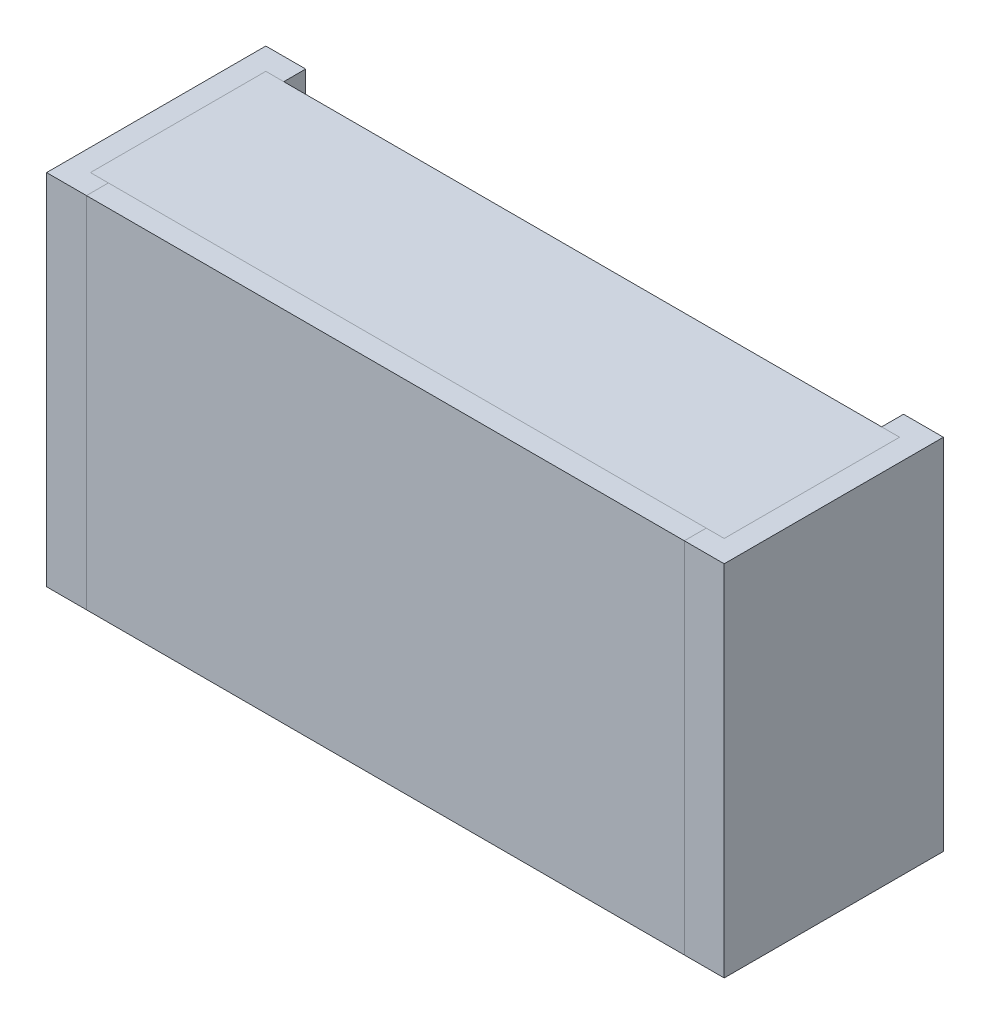
ISO-10303-21;
HEADER;
FILE_DESCRIPTION(('STEP AP214'),'2;1');
FILE_NAME('part.step','',(''),(''),'','','');
FILE_SCHEMA(('AUTOMOTIVE_DESIGN { 1 0 10303 214 1 1 1 1 }'));
ENDSEC;
DATA;
#1=APPLICATION_CONTEXT('core data for automotive mechanical design processes');
#2=APPLICATION_PROTOCOL_DEFINITION('international standard','automotive_design',2000,#1);
#3=PRODUCT_CONTEXT('',#1,'mechanical');
#4=PRODUCT('Part','Part','',(#3));
#5=PRODUCT_RELATED_PRODUCT_CATEGORY('part','',(#4));
#6=PRODUCT_DEFINITION_FORMATION('','',#4);
#7=PRODUCT_DEFINITION_CONTEXT('part definition',#1,'design');
#8=PRODUCT_DEFINITION('design','',#6,#7);
#9=PRODUCT_DEFINITION_SHAPE('','',#8);
#10=(LENGTH_UNIT() NAMED_UNIT(*) SI_UNIT(.MILLI.,.METRE.));
#11=(NAMED_UNIT(*) PLANE_ANGLE_UNIT() SI_UNIT($,.RADIAN.));
#12=(NAMED_UNIT(*) SI_UNIT($,.STERADIAN.) SOLID_ANGLE_UNIT());
#13=UNCERTAINTY_MEASURE_WITH_UNIT(LENGTH_MEASURE(1.E-05),#10,'distance_accuracy_value','');
#14=(GEOMETRIC_REPRESENTATION_CONTEXT(3) GLOBAL_UNCERTAINTY_ASSIGNED_CONTEXT((#13)) GLOBAL_UNIT_ASSIGNED_CONTEXT((#10,
#11,#12)) REPRESENTATION_CONTEXT('',''));
#15=CARTESIAN_POINT('',(0.,0.,0.));
#16=DIRECTION('',(0.,0.,1.));
#17=DIRECTION('',(1.,0.,0.));
#18=AXIS2_PLACEMENT_3D('',#15,#16,#17);
#19=CARTESIAN_POINT('',(-0.79491872,-0.44991872,0.055));
#20=DIRECTION('',(1.,0.,0.));
#21=DIRECTION('',(0.,0.,1.));
#22=AXIS2_PLACEMENT_3D('',#19,#20,#21);
#23=PLANE('',#22);
#24=DIRECTION('',(0.,1.,0.));
#25=VECTOR('',#24,1.);
#26=CARTESIAN_POINT('',(-0.79491872,-0.44991872,0.495));
#27=LINE('',#26,#25);
#28=CARTESIAN_POINT('',(-0.79491872,-0.44991872,0.495));
#29=VERTEX_POINT('',#28);
#30=CARTESIAN_POINT('',(-0.79491872,0.45008128,0.495));
#31=VERTEX_POINT('',#30);
#32=EDGE_CURVE('P0_E11',#29,#31,#27,.T.);
#33=ORIENTED_EDGE('',*,*,#32,.T.);
#34=DIRECTION('',(0.,0.,1.));
#35=VECTOR('',#34,1.);
#36=CARTESIAN_POINT('',(-0.79491872,0.45008128,0.055));
#37=LINE('',#36,#35);
#38=CARTESIAN_POINT('',(-0.79491872,0.45008128,0.055));
#39=VERTEX_POINT('',#38);
#40=EDGE_CURVE('P0_E24',#39,#31,#37,.T.);
#41=ORIENTED_EDGE('',*,*,#40,.F.);
#42=DIRECTION('',(0.,1.,0.));
#43=VECTOR('',#42,1.);
#44=CARTESIAN_POINT('',(-0.79491872,-0.44991872,0.055));
#45=LINE('',#44,#43);
#46=CARTESIAN_POINT('',(-0.79491872,-0.44991872,0.055));
#47=VERTEX_POINT('',#46);
#48=EDGE_CURVE('P0_E86',#47,#39,#45,.T.);
#49=ORIENTED_EDGE('',*,*,#48,.F.);
#50=DIRECTION('',(0.,0.,1.));
#51=VECTOR('',#50,1.);
#52=CARTESIAN_POINT('',(-0.79491872,-0.44991872,0.055));
#53=LINE('',#52,#51);
#54=EDGE_CURVE('P0_E36',#47,#29,#53,.T.);
#55=ORIENTED_EDGE('',*,*,#54,.T.);
#56=EDGE_LOOP('',(#33,#41,#49,#55));
#57=FACE_BOUND('',#56,.T.);
#58=ADVANCED_FACE('P0_F17',(#57),#23,.F.);
#59=CARTESIAN_POINT('',(0.79508128,-0.44991872,0.055));
#60=DIRECTION('',(1.,0.,0.));
#61=DIRECTION('',(0.,0.,1.));
#62=AXIS2_PLACEMENT_3D('',#59,#60,#61);
#63=PLANE('',#62);
#64=DIRECTION('',(0.,0.,1.));
#65=VECTOR('',#64,1.);
#66=CARTESIAN_POINT('',(0.79508128,-0.44991872,0.055));
#67=LINE('',#66,#65);
#68=CARTESIAN_POINT('',(0.79508128,-0.44991872,0.055));
#69=VERTEX_POINT('',#68);
#70=CARTESIAN_POINT('',(0.79508128,-0.44991872,0.495));
#71=VERTEX_POINT('',#70);
#72=EDGE_CURVE('P0_E83',#69,#71,#67,.T.);
#73=ORIENTED_EDGE('',*,*,#72,.F.);
#74=DIRECTION('',(0.,1.,0.));
#75=VECTOR('',#74,1.);
#76=CARTESIAN_POINT('',(0.79508128,-0.44991872,0.055));
#77=LINE('',#76,#75);
#78=CARTESIAN_POINT('',(0.79508128,0.45008128,0.055));
#79=VERTEX_POINT('',#78);
#80=EDGE_CURVE('P0_E63',#69,#79,#77,.T.);
#81=ORIENTED_EDGE('',*,*,#80,.T.);
#82=DIRECTION('',(0.,0.,1.));
#83=VECTOR('',#82,1.);
#84=CARTESIAN_POINT('',(0.79508128,0.45008128,0.055));
#85=LINE('',#84,#83);
#86=CARTESIAN_POINT('',(0.79508128,0.45008128,0.495));
#87=VERTEX_POINT('',#86);
#88=EDGE_CURVE('P0_E57',#79,#87,#85,.T.);
#89=ORIENTED_EDGE('',*,*,#88,.T.);
#90=DIRECTION('',(0.,1.,0.));
#91=VECTOR('',#90,1.);
#92=CARTESIAN_POINT('',(0.79508128,-0.44991872,0.495));
#93=LINE('',#92,#91);
#94=EDGE_CURVE('P0_E60',#71,#87,#93,.T.);
#95=ORIENTED_EDGE('',*,*,#94,.F.);
#96=EDGE_LOOP('',(#73,#81,#89,#95));
#97=FACE_BOUND('',#96,.T.);
#98=ADVANCED_FACE('P0_F59',(#97),#63,.T.);
#99=CARTESIAN_POINT('',(-0.79491872,-0.44991872,0.055));
#100=DIRECTION('',(0.,1.,0.));
#101=DIRECTION('',(0.,0.,1.));
#102=AXIS2_PLACEMENT_3D('',#99,#100,#101);
#103=PLANE('',#102);
#104=ORIENTED_EDGE('',*,*,#72,.T.);
#105=DIRECTION('',(1.,0.,0.));
#106=VECTOR('',#105,1.);
#107=CARTESIAN_POINT('',(-0.79491872,-0.44991872,0.495));
#108=LINE('',#107,#106);
#109=EDGE_CURVE('P0_E71',#29,#71,#108,.T.);
#110=ORIENTED_EDGE('',*,*,#109,.F.);
#111=ORIENTED_EDGE('',*,*,#54,.F.);
#112=DIRECTION('',(1.,0.,0.));
#113=VECTOR('',#112,1.);
#114=CARTESIAN_POINT('',(-0.79491872,-0.44991872,0.055));
#115=LINE('',#114,#113);
#116=EDGE_CURVE('P0_E76',#47,#69,#115,.T.);
#117=ORIENTED_EDGE('',*,*,#116,.T.);
#118=EDGE_LOOP('',(#104,#110,#111,#117));
#119=FACE_BOUND('',#118,.T.);
#120=ADVANCED_FACE('P0_F91',(#119),#103,.F.);
#121=CARTESIAN_POINT('',(-0.79491872,0.45008128,0.055));
#122=DIRECTION('',(0.,1.,0.));
#123=DIRECTION('',(0.,0.,1.));
#124=AXIS2_PLACEMENT_3D('',#121,#122,#123);
#125=PLANE('',#124);
#126=DIRECTION('',(1.,0.,0.));
#127=VECTOR('',#126,1.);
#128=CARTESIAN_POINT('',(-0.79491872,0.45008128,0.055));
#129=LINE('',#128,#127);
#130=EDGE_CURVE('P0_E74',#39,#79,#129,.T.);
#131=ORIENTED_EDGE('',*,*,#130,.F.);
#132=ORIENTED_EDGE('',*,*,#40,.T.);
#133=DIRECTION('',(1.,0.,0.));
#134=VECTOR('',#133,1.);
#135=CARTESIAN_POINT('',(-0.79491872,0.45008128,0.495));
#136=LINE('',#135,#134);
#137=EDGE_CURVE('P0_E69',#31,#87,#136,.T.);
#138=ORIENTED_EDGE('',*,*,#137,.T.);
#139=ORIENTED_EDGE('',*,*,#88,.F.);
#140=EDGE_LOOP('',(#131,#132,#138,#139));
#141=FACE_BOUND('',#140,.T.);
#142=ADVANCED_FACE('P0_F73',(#141),#125,.T.);
#143=CARTESIAN_POINT('',(-0.79491872,-0.44991872,0.055));
#144=DIRECTION('',(0.,0.,1.));
#145=DIRECTION('',(1.,0.,0.));
#146=AXIS2_PLACEMENT_3D('',#143,#144,#145);
#147=PLANE('',#146);
#148=ORIENTED_EDGE('',*,*,#130,.T.);
#149=ORIENTED_EDGE('',*,*,#80,.F.);
#150=ORIENTED_EDGE('',*,*,#116,.F.);
#151=ORIENTED_EDGE('',*,*,#48,.T.);
#152=EDGE_LOOP('',(#148,#149,#150,#151));
#153=FACE_BOUND('',#152,.T.);
#154=ADVANCED_FACE('P0_F89',(#153),#147,.F.);
#155=CARTESIAN_POINT('',(-0.79491872,-0.44991872,0.495));
#156=DIRECTION('',(0.,0.,1.));
#157=DIRECTION('',(1.,0.,0.));
#158=AXIS2_PLACEMENT_3D('',#155,#156,#157);
#159=PLANE('',#158);
#160=ORIENTED_EDGE('',*,*,#32,.F.);
#161=ORIENTED_EDGE('',*,*,#109,.T.);
#162=ORIENTED_EDGE('',*,*,#94,.T.);
#163=ORIENTED_EDGE('',*,*,#137,.F.);
#164=EDGE_LOOP('',(#160,#161,#162,#163));
#165=FACE_BOUND('',#164,.T.);
#166=ADVANCED_FACE('P0_F68',(#165),#159,.T.);
#167=CLOSED_SHELL('',(#58,#98,#120,#142,#154,#166));
#168=MANIFOLD_SOLID_BREP('P0_B1',#167);
#169=CARTESIAN_POINT('',(-0.84991872,-0.44991872,0.));
#170=DIRECTION('',(1.,0.,0.));
#171=DIRECTION('',(0.,0.,1.));
#172=AXIS2_PLACEMENT_3D('',#169,#170,#171);
#173=PLANE('',#172);
#174=DIRECTION('',(0.,1.,0.));
#175=VECTOR('',#174,1.);
#176=CARTESIAN_POINT('',(-0.84991872,-0.44991872,0.55));
#177=LINE('',#176,#175);
#178=CARTESIAN_POINT('',(-0.84991872,-0.44991872,0.55));
#179=VERTEX_POINT('',#178);
#180=CARTESIAN_POINT('',(-0.84991872,0.45008128,0.55));
#181=VERTEX_POINT('',#180);
#182=EDGE_CURVE('P1_E11',#179,#181,#177,.T.);
#183=ORIENTED_EDGE('',*,*,#182,.T.);
#184=DIRECTION('',(0.,0.,1.));
#185=VECTOR('',#184,1.);
#186=CARTESIAN_POINT('',(-0.84991872,0.45008128,0.));
#187=LINE('',#186,#185);
#188=CARTESIAN_POINT('',(-0.84991872,0.45008128,0.));
#189=VERTEX_POINT('',#188);
#190=EDGE_CURVE('P1_E24',#189,#181,#187,.T.);
#191=ORIENTED_EDGE('',*,*,#190,.F.);
#192=DIRECTION('',(0.,1.,0.));
#193=VECTOR('',#192,1.);
#194=CARTESIAN_POINT('',(-0.84991872,-0.44991872,0.));
#195=LINE('',#194,#193);
#196=CARTESIAN_POINT('',(-0.84991872,-0.44991872,0.));
#197=VERTEX_POINT('',#196);
#198=EDGE_CURVE('P1_E144',#197,#189,#195,.T.);
#199=ORIENTED_EDGE('',*,*,#198,.F.);
#200=DIRECTION('',(0.,0.,1.));
#201=VECTOR('',#200,1.);
#202=CARTESIAN_POINT('',(-0.84991872,-0.44991872,0.));
#203=LINE('',#202,#201);
#204=EDGE_CURVE('P1_E36',#197,#179,#203,.T.);
#205=ORIENTED_EDGE('',*,*,#204,.T.);
#206=EDGE_LOOP('',(#183,#191,#199,#205));
#207=FACE_BOUND('',#206,.T.);
#208=ADVANCED_FACE('P1_F17',(#207),#173,.F.);
#209=CARTESIAN_POINT('',(-0.84991872,-0.44991872,0.));
#210=DIRECTION('',(0.,1.,0.));
#211=DIRECTION('',(0.,0.,1.));
#212=AXIS2_PLACEMENT_3D('',#209,#210,#211);
#213=PLANE('',#212);
#214=DIRECTION('',(1.,0.,0.));
#215=VECTOR('',#214,1.);
#216=CARTESIAN_POINT('',(-0.79491872,-0.44991872,0.055));
#217=LINE('',#216,#215);
#218=CARTESIAN_POINT('',(-0.79491872,-0.44991872,0.055));
#219=VERTEX_POINT('',#218);
#220=CARTESIAN_POINT('',(-0.74991872,-0.44991872,0.055));
#221=VERTEX_POINT('',#220);
#222=EDGE_CURVE('P1_E141',#219,#221,#217,.T.);
#223=ORIENTED_EDGE('',*,*,#222,.F.);
#224=DIRECTION('',(0.,0.,1.));
#225=VECTOR('',#224,1.);
#226=CARTESIAN_POINT('',(-0.79491872,-0.44991872,0.055));
#227=LINE('',#226,#225);
#228=CARTESIAN_POINT('',(-0.79491872,-0.44991872,0.495));
#229=VERTEX_POINT('',#228);
#230=EDGE_CURVE('P1_E103',#219,#229,#227,.T.);
#231=ORIENTED_EDGE('',*,*,#230,.T.);
#232=DIRECTION('',(1.,0.,0.));
#233=VECTOR('',#232,1.);
#234=CARTESIAN_POINT('',(-0.79491872,-0.44991872,0.495));
#235=LINE('',#234,#233);
#236=CARTESIAN_POINT('',(-0.74991872,-0.44991872,0.495));
#237=VERTEX_POINT('',#236);
#238=EDGE_CURVE('P1_E137',#229,#237,#235,.T.);
#239=ORIENTED_EDGE('',*,*,#238,.T.);
#240=DIRECTION('',(0.,0.,1.));
#241=VECTOR('',#240,1.);
#242=CARTESIAN_POINT('',(-0.74991872,-0.44991872,0.));
#243=LINE('',#242,#241);
#244=CARTESIAN_POINT('',(-0.74991872,-0.44991872,0.55));
#245=VERTEX_POINT('',#244);
#246=EDGE_CURVE('P1_E134',#237,#245,#243,.T.);
#247=ORIENTED_EDGE('',*,*,#246,.T.);
#248=DIRECTION('',(1.,0.,0.));
#249=VECTOR('',#248,1.);
#250=CARTESIAN_POINT('',(-0.84991872,-0.44991872,0.55));
#251=LINE('',#250,#249);
#252=EDGE_CURVE('P1_E132',#179,#245,#251,.T.);
#253=ORIENTED_EDGE('',*,*,#252,.F.);
#254=ORIENTED_EDGE('',*,*,#204,.F.);
#255=DIRECTION('',(1.,0.,0.));
#256=VECTOR('',#255,1.);
#257=CARTESIAN_POINT('',(-0.84991872,-0.44991872,0.));
#258=LINE('',#257,#256);
#259=CARTESIAN_POINT('',(-0.74991872,-0.44991872,0.));
#260=VERTEX_POINT('',#259);
#261=EDGE_CURVE('P1_E129',#197,#260,#258,.T.);
#262=ORIENTED_EDGE('',*,*,#261,.T.);
#263=DIRECTION('',(0.,0.,1.));
#264=VECTOR('',#263,1.);
#265=CARTESIAN_POINT('',(-0.74991872,-0.44991872,0.));
#266=LINE('',#265,#264);
#267=EDGE_CURVE('P1_E127',#260,#221,#266,.T.);
#268=ORIENTED_EDGE('',*,*,#267,.T.);
#269=EDGE_LOOP('',(#223,#231,#239,#247,#253,#254,#262,#268));
#270=FACE_BOUND('',#269,.T.);
#271=ADVANCED_FACE('P1_F153',(#270),#213,.F.);
#272=CARTESIAN_POINT('',(-0.84991872,-0.44991872,0.55));
#273=DIRECTION('',(0.,0.,1.));
#274=DIRECTION('',(1.,0.,0.));
#275=AXIS2_PLACEMENT_3D('',#272,#273,#274);
#276=PLANE('',#275);
#277=ORIENTED_EDGE('',*,*,#182,.F.);
#278=ORIENTED_EDGE('',*,*,#252,.T.);
#279=DIRECTION('',(0.,1.,0.));
#280=VECTOR('',#279,1.);
#281=CARTESIAN_POINT('',(-0.74991872,-0.44991872,0.55));
#282=LINE('',#281,#280);
#283=CARTESIAN_POINT('',(-0.74991872,0.45008128,0.55));
#284=VERTEX_POINT('',#283);
#285=EDGE_CURVE('P1_E125',#245,#284,#282,.T.);
#286=ORIENTED_EDGE('',*,*,#285,.T.);
#287=DIRECTION('',(1.,0.,0.));
#288=VECTOR('',#287,1.);
#289=CARTESIAN_POINT('',(-0.84991872,0.45008128,0.55));
#290=LINE('',#289,#288);
#291=EDGE_CURVE('P1_E123',#181,#284,#290,.T.);
#292=ORIENTED_EDGE('',*,*,#291,.F.);
#293=EDGE_LOOP('',(#277,#278,#286,#292));
#294=FACE_BOUND('',#293,.T.);
#295=ADVANCED_FACE('P1_F157',(#294),#276,.T.);
#296=CARTESIAN_POINT('',(-0.84991872,0.45008128,0.));
#297=DIRECTION('',(0.,1.,0.));
#298=DIRECTION('',(0.,0.,1.));
#299=AXIS2_PLACEMENT_3D('',#296,#297,#298);
#300=PLANE('',#299);
#301=DIRECTION('',(0.,0.,1.));
#302=VECTOR('',#301,1.);
#303=CARTESIAN_POINT('',(-0.74991872,0.45008128,0.));
#304=LINE('',#303,#302);
#305=CARTESIAN_POINT('',(-0.74991872,0.45008128,0.));
#306=VERTEX_POINT('',#305);
#307=CARTESIAN_POINT('',(-0.74991872,0.45008128,0.055));
#308=VERTEX_POINT('',#307);
#309=EDGE_CURVE('P1_E121',#306,#308,#304,.T.);
#310=ORIENTED_EDGE('',*,*,#309,.F.);
#311=DIRECTION('',(1.,0.,0.));
#312=VECTOR('',#311,1.);
#313=CARTESIAN_POINT('',(-0.84991872,0.45008128,0.));
#314=LINE('',#313,#312);
#315=EDGE_CURVE('P1_E118',#189,#306,#314,.T.);
#316=ORIENTED_EDGE('',*,*,#315,.F.);
#317=ORIENTED_EDGE('',*,*,#190,.T.);
#318=ORIENTED_EDGE('',*,*,#291,.T.);
#319=DIRECTION('',(0.,0.,1.));
#320=VECTOR('',#319,1.);
#321=CARTESIAN_POINT('',(-0.74991872,0.45008128,0.));
#322=LINE('',#321,#320);
#323=CARTESIAN_POINT('',(-0.74991872,0.45008128,0.495));
#324=VERTEX_POINT('',#323);
#325=EDGE_CURVE('P1_E115',#324,#284,#322,.T.);
#326=ORIENTED_EDGE('',*,*,#325,.F.);
#327=DIRECTION('',(1.,0.,0.));
#328=VECTOR('',#327,1.);
#329=CARTESIAN_POINT('',(-0.79491872,0.45008128,0.495));
#330=LINE('',#329,#328);
#331=CARTESIAN_POINT('',(-0.79491872,0.45008128,0.495));
#332=VERTEX_POINT('',#331);
#333=EDGE_CURVE('P1_E86',#332,#324,#330,.T.);
#334=ORIENTED_EDGE('',*,*,#333,.F.);
#335=DIRECTION('',(0.,0.,1.));
#336=VECTOR('',#335,1.);
#337=CARTESIAN_POINT('',(-0.79491872,0.45008128,0.055));
#338=LINE('',#337,#336);
#339=CARTESIAN_POINT('',(-0.79491872,0.45008128,0.055));
#340=VERTEX_POINT('',#339);
#341=EDGE_CURVE('P1_E80',#340,#332,#338,.T.);
#342=ORIENTED_EDGE('',*,*,#341,.F.);
#343=DIRECTION('',(1.,0.,0.));
#344=VECTOR('',#343,1.);
#345=CARTESIAN_POINT('',(-0.79491872,0.45008128,0.055));
#346=LINE('',#345,#344);
#347=EDGE_CURVE('P1_E83',#340,#308,#346,.T.);
#348=ORIENTED_EDGE('',*,*,#347,.T.);
#349=EDGE_LOOP('',(#310,#316,#317,#318,#326,#334,#342,#348));
#350=FACE_BOUND('',#349,.T.);
#351=ADVANCED_FACE('P1_F82',(#350),#300,.T.);
#352=CARTESIAN_POINT('',(-0.84991872,-0.44991872,0.));
#353=DIRECTION('',(0.,0.,1.));
#354=DIRECTION('',(1.,0.,0.));
#355=AXIS2_PLACEMENT_3D('',#352,#353,#354);
#356=PLANE('',#355);
#357=ORIENTED_EDGE('',*,*,#315,.T.);
#358=DIRECTION('',(0.,1.,0.));
#359=VECTOR('',#358,1.);
#360=CARTESIAN_POINT('',(-0.74991872,-0.44991872,0.));
#361=LINE('',#360,#359);
#362=EDGE_CURVE('P1_E99',#260,#306,#361,.T.);
#363=ORIENTED_EDGE('',*,*,#362,.F.);
#364=ORIENTED_EDGE('',*,*,#261,.F.);
#365=ORIENTED_EDGE('',*,*,#198,.T.);
#366=EDGE_LOOP('',(#357,#363,#364,#365));
#367=FACE_BOUND('',#366,.T.);
#368=ADVANCED_FACE('P1_F147',(#367),#356,.F.);
#369=CARTESIAN_POINT('',(-0.74991872,-0.44991872,0.));
#370=DIRECTION('',(1.,0.,0.));
#371=DIRECTION('',(0.,0.,1.));
#372=AXIS2_PLACEMENT_3D('',#369,#370,#371);
#373=PLANE('',#372);
#374=ORIENTED_EDGE('',*,*,#267,.F.);
#375=ORIENTED_EDGE('',*,*,#362,.T.);
#376=ORIENTED_EDGE('',*,*,#309,.T.);
#377=DIRECTION('',(0.,-1.,0.));
#378=VECTOR('',#377,1.);
#379=CARTESIAN_POINT('',(-0.74991872,-0.44991872,0.055));
#380=LINE('',#379,#378);
#381=EDGE_CURVE('P1_E98',#308,#221,#380,.T.);
#382=ORIENTED_EDGE('',*,*,#381,.T.);
#383=EDGE_LOOP('',(#374,#375,#376,#382));
#384=FACE_BOUND('',#383,.T.);
#385=ADVANCED_FACE('P1_F151',(#384),#373,.T.);
#386=CARTESIAN_POINT('',(-0.79491872,-0.44991872,0.055));
#387=DIRECTION('',(0.,0.,1.));
#388=DIRECTION('',(1.,0.,0.));
#389=AXIS2_PLACEMENT_3D('',#386,#387,#388);
#390=PLANE('',#389);
#391=ORIENTED_EDGE('',*,*,#347,.F.);
#392=DIRECTION('',(0.,1.,0.));
#393=VECTOR('',#392,1.);
#394=CARTESIAN_POINT('',(-0.79491872,-0.44991872,0.055));
#395=LINE('',#394,#393);
#396=EDGE_CURVE('P1_E96',#219,#340,#395,.T.);
#397=ORIENTED_EDGE('',*,*,#396,.F.);
#398=ORIENTED_EDGE('',*,*,#222,.T.);
#399=ORIENTED_EDGE('',*,*,#381,.F.);
#400=EDGE_LOOP('',(#391,#397,#398,#399));
#401=FACE_BOUND('',#400,.T.);
#402=ADVANCED_FACE('P1_F94',(#401),#390,.T.);
#403=CARTESIAN_POINT('',(-0.79491872,-0.44991872,0.055));
#404=DIRECTION('',(1.,0.,0.));
#405=DIRECTION('',(0.,0.,1.));
#406=AXIS2_PLACEMENT_3D('',#403,#404,#405);
#407=PLANE('',#406);
#408=ORIENTED_EDGE('',*,*,#230,.F.);
#409=ORIENTED_EDGE('',*,*,#396,.T.);
#410=ORIENTED_EDGE('',*,*,#341,.T.);
#411=DIRECTION('',(0.,1.,0.));
#412=VECTOR('',#411,1.);
#413=CARTESIAN_POINT('',(-0.79491872,-0.44991872,0.495));
#414=LINE('',#413,#412);
#415=EDGE_CURVE('P1_E105',#229,#332,#414,.T.);
#416=ORIENTED_EDGE('',*,*,#415,.F.);
#417=EDGE_LOOP('',(#408,#409,#410,#416));
#418=FACE_BOUND('',#417,.T.);
#419=ADVANCED_FACE('P1_F101',(#418),#407,.T.);
#420=CARTESIAN_POINT('',(-0.79491872,-0.44991872,0.495));
#421=DIRECTION('',(0.,0.,1.));
#422=DIRECTION('',(1.,0.,0.));
#423=AXIS2_PLACEMENT_3D('',#420,#421,#422);
#424=PLANE('',#423);
#425=DIRECTION('',(0.,-1.,0.));
#426=VECTOR('',#425,1.);
#427=CARTESIAN_POINT('',(-0.74991872,-0.44991872,0.495));
#428=LINE('',#427,#426);
#429=EDGE_CURVE('P1_E108',#324,#237,#428,.T.);
#430=ORIENTED_EDGE('',*,*,#429,.T.);
#431=ORIENTED_EDGE('',*,*,#238,.F.);
#432=ORIENTED_EDGE('',*,*,#415,.T.);
#433=ORIENTED_EDGE('',*,*,#333,.T.);
#434=EDGE_LOOP('',(#430,#431,#432,#433));
#435=FACE_BOUND('',#434,.T.);
#436=ADVANCED_FACE('P1_F163',(#435),#424,.F.);
#437=CARTESIAN_POINT('',(-0.74991872,-0.44991872,0.));
#438=DIRECTION('',(1.,0.,0.));
#439=DIRECTION('',(0.,0.,1.));
#440=AXIS2_PLACEMENT_3D('',#437,#438,#439);
#441=PLANE('',#440);
#442=ORIENTED_EDGE('',*,*,#246,.F.);
#443=ORIENTED_EDGE('',*,*,#429,.F.);
#444=ORIENTED_EDGE('',*,*,#325,.T.);
#445=ORIENTED_EDGE('',*,*,#285,.F.);
#446=EDGE_LOOP('',(#442,#443,#444,#445));
#447=FACE_BOUND('',#446,.T.);
#448=ADVANCED_FACE('P1_F160',(#447),#441,.T.);
#449=CLOSED_SHELL('',(#208,#271,#295,#351,#368,#385,#402,#419,#436,#448));
#450=MANIFOLD_SOLID_BREP('P1_B1',#449);
#451=CARTESIAN_POINT('',(0.85008128,0.45008128,0.));
#452=DIRECTION('',(-1.,0.,0.));
#453=DIRECTION('',(0.,0.,1.));
#454=AXIS2_PLACEMENT_3D('',#451,#452,#453);
#455=PLANE('',#454);
#456=DIRECTION('',(0.,-1.,0.));
#457=VECTOR('',#456,1.);
#458=CARTESIAN_POINT('',(0.85008128,0.45008128,0.55));
#459=LINE('',#458,#457);
#460=CARTESIAN_POINT('',(0.85008128,0.45008128,0.55));
#461=VERTEX_POINT('',#460);
#462=CARTESIAN_POINT('',(0.85008128,-0.44991872,0.55));
#463=VERTEX_POINT('',#462);
#464=EDGE_CURVE('P2_E11',#461,#463,#459,.T.);
#465=ORIENTED_EDGE('',*,*,#464,.T.);
#466=DIRECTION('',(0.,0.,1.));
#467=VECTOR('',#466,1.);
#468=CARTESIAN_POINT('',(0.85008128,-0.44991872,0.));
#469=LINE('',#468,#467);
#470=CARTESIAN_POINT('',(0.85008128,-0.44991872,0.));
#471=VERTEX_POINT('',#470);
#472=EDGE_CURVE('P2_E24',#471,#463,#469,.T.);
#473=ORIENTED_EDGE('',*,*,#472,.F.);
#474=DIRECTION('',(0.,-1.,0.));
#475=VECTOR('',#474,1.);
#476=CARTESIAN_POINT('',(0.85008128,0.45008128,0.));
#477=LINE('',#476,#475);
#478=CARTESIAN_POINT('',(0.85008128,0.45008128,0.));
#479=VERTEX_POINT('',#478);
#480=EDGE_CURVE('P2_E144',#479,#471,#477,.T.);
#481=ORIENTED_EDGE('',*,*,#480,.F.);
#482=DIRECTION('',(0.,0.,1.));
#483=VECTOR('',#482,1.);
#484=CARTESIAN_POINT('',(0.85008128,0.45008128,0.));
#485=LINE('',#484,#483);
#486=EDGE_CURVE('P2_E36',#479,#461,#485,.T.);
#487=ORIENTED_EDGE('',*,*,#486,.T.);
#488=EDGE_LOOP('',(#465,#473,#481,#487));
#489=FACE_BOUND('',#488,.T.);
#490=ADVANCED_FACE('P2_F17',(#489),#455,.F.);
#491=CARTESIAN_POINT('',(0.85008128,0.45008128,0.));
#492=DIRECTION('',(0.,-1.,0.));
#493=DIRECTION('',(0.,0.,1.));
#494=AXIS2_PLACEMENT_3D('',#491,#492,#493);
#495=PLANE('',#494);
#496=DIRECTION('',(-1.,0.,0.));
#497=VECTOR('',#496,1.);
#498=CARTESIAN_POINT('',(0.79508128,0.45008128,0.055));
#499=LINE('',#498,#497);
#500=CARTESIAN_POINT('',(0.79508128,0.45008128,0.055));
#501=VERTEX_POINT('',#500);
#502=CARTESIAN_POINT('',(0.75008128,0.45008128,0.055));
#503=VERTEX_POINT('',#502);
#504=EDGE_CURVE('P2_E141',#501,#503,#499,.T.);
#505=ORIENTED_EDGE('',*,*,#504,.F.);
#506=DIRECTION('',(0.,0.,1.));
#507=VECTOR('',#506,1.);
#508=CARTESIAN_POINT('',(0.79508128,0.45008128,0.055));
#509=LINE('',#508,#507);
#510=CARTESIAN_POINT('',(0.79508128,0.45008128,0.495));
#511=VERTEX_POINT('',#510);
#512=EDGE_CURVE('P2_E103',#501,#511,#509,.T.);
#513=ORIENTED_EDGE('',*,*,#512,.T.);
#514=DIRECTION('',(-1.,0.,0.));
#515=VECTOR('',#514,1.);
#516=CARTESIAN_POINT('',(0.79508128,0.45008128,0.495));
#517=LINE('',#516,#515);
#518=CARTESIAN_POINT('',(0.75008128,0.45008128,0.495));
#519=VERTEX_POINT('',#518);
#520=EDGE_CURVE('P2_E137',#511,#519,#517,.T.);
#521=ORIENTED_EDGE('',*,*,#520,.T.);
#522=DIRECTION('',(0.,0.,1.));
#523=VECTOR('',#522,1.);
#524=CARTESIAN_POINT('',(0.75008128,0.45008128,0.));
#525=LINE('',#524,#523);
#526=CARTESIAN_POINT('',(0.75008128,0.45008128,0.55));
#527=VERTEX_POINT('',#526);
#528=EDGE_CURVE('P2_E134',#519,#527,#525,.T.);
#529=ORIENTED_EDGE('',*,*,#528,.T.);
#530=DIRECTION('',(-1.,0.,0.));
#531=VECTOR('',#530,1.);
#532=CARTESIAN_POINT('',(0.85008128,0.45008128,0.55));
#533=LINE('',#532,#531);
#534=EDGE_CURVE('P2_E132',#461,#527,#533,.T.);
#535=ORIENTED_EDGE('',*,*,#534,.F.);
#536=ORIENTED_EDGE('',*,*,#486,.F.);
#537=DIRECTION('',(-1.,0.,0.));
#538=VECTOR('',#537,1.);
#539=CARTESIAN_POINT('',(0.85008128,0.45008128,0.));
#540=LINE('',#539,#538);
#541=CARTESIAN_POINT('',(0.75008128,0.45008128,0.));
#542=VERTEX_POINT('',#541);
#543=EDGE_CURVE('P2_E129',#479,#542,#540,.T.);
#544=ORIENTED_EDGE('',*,*,#543,.T.);
#545=DIRECTION('',(0.,0.,1.));
#546=VECTOR('',#545,1.);
#547=CARTESIAN_POINT('',(0.75008128,0.45008128,0.));
#548=LINE('',#547,#546);
#549=EDGE_CURVE('P2_E127',#542,#503,#548,.T.);
#550=ORIENTED_EDGE('',*,*,#549,.T.);
#551=EDGE_LOOP('',(#505,#513,#521,#529,#535,#536,#544,#550));
#552=FACE_BOUND('',#551,.T.);
#553=ADVANCED_FACE('P2_F153',(#552),#495,.F.);
#554=CARTESIAN_POINT('',(0.85008128,0.45008128,0.55));
#555=DIRECTION('',(0.,0.,1.));
#556=DIRECTION('',(-1.,0.,0.));
#557=AXIS2_PLACEMENT_3D('',#554,#555,#556);
#558=PLANE('',#557);
#559=ORIENTED_EDGE('',*,*,#464,.F.);
#560=ORIENTED_EDGE('',*,*,#534,.T.);
#561=DIRECTION('',(0.,-1.,0.));
#562=VECTOR('',#561,1.);
#563=CARTESIAN_POINT('',(0.75008128,0.45008128,0.55));
#564=LINE('',#563,#562);
#565=CARTESIAN_POINT('',(0.75008128,-0.44991872,0.55));
#566=VERTEX_POINT('',#565);
#567=EDGE_CURVE('P2_E125',#527,#566,#564,.T.);
#568=ORIENTED_EDGE('',*,*,#567,.T.);
#569=DIRECTION('',(-1.,0.,0.));
#570=VECTOR('',#569,1.);
#571=CARTESIAN_POINT('',(0.85008128,-0.44991872,0.55));
#572=LINE('',#571,#570);
#573=EDGE_CURVE('P2_E123',#463,#566,#572,.T.);
#574=ORIENTED_EDGE('',*,*,#573,.F.);
#575=EDGE_LOOP('',(#559,#560,#568,#574));
#576=FACE_BOUND('',#575,.T.);
#577=ADVANCED_FACE('P2_F157',(#576),#558,.T.);
#578=CARTESIAN_POINT('',(0.85008128,-0.44991872,0.));
#579=DIRECTION('',(0.,-1.,0.));
#580=DIRECTION('',(0.,0.,1.));
#581=AXIS2_PLACEMENT_3D('',#578,#579,#580);
#582=PLANE('',#581);
#583=DIRECTION('',(0.,0.,1.));
#584=VECTOR('',#583,1.);
#585=CARTESIAN_POINT('',(0.75008128,-0.44991872,0.));
#586=LINE('',#585,#584);
#587=CARTESIAN_POINT('',(0.75008128,-0.44991872,0.));
#588=VERTEX_POINT('',#587);
#589=CARTESIAN_POINT('',(0.75008128,-0.44991872,0.055));
#590=VERTEX_POINT('',#589);
#591=EDGE_CURVE('P2_E121',#588,#590,#586,.T.);
#592=ORIENTED_EDGE('',*,*,#591,.F.);
#593=DIRECTION('',(-1.,0.,0.));
#594=VECTOR('',#593,1.);
#595=CARTESIAN_POINT('',(0.85008128,-0.44991872,0.));
#596=LINE('',#595,#594);
#597=EDGE_CURVE('P2_E118',#471,#588,#596,.T.);
#598=ORIENTED_EDGE('',*,*,#597,.F.);
#599=ORIENTED_EDGE('',*,*,#472,.T.);
#600=ORIENTED_EDGE('',*,*,#573,.T.);
#601=DIRECTION('',(0.,0.,1.));
#602=VECTOR('',#601,1.);
#603=CARTESIAN_POINT('',(0.75008128,-0.44991872,0.));
#604=LINE('',#603,#602);
#605=CARTESIAN_POINT('',(0.75008128,-0.44991872,0.495));
#606=VERTEX_POINT('',#605);
#607=EDGE_CURVE('P2_E115',#606,#566,#604,.T.);
#608=ORIENTED_EDGE('',*,*,#607,.F.);
#609=DIRECTION('',(-1.,0.,0.));
#610=VECTOR('',#609,1.);
#611=CARTESIAN_POINT('',(0.79508128,-0.44991872,0.495));
#612=LINE('',#611,#610);
#613=CARTESIAN_POINT('',(0.79508128,-0.44991872,0.495));
#614=VERTEX_POINT('',#613);
#615=EDGE_CURVE('P2_E86',#614,#606,#612,.T.);
#616=ORIENTED_EDGE('',*,*,#615,.F.);
#617=DIRECTION('',(0.,0.,1.));
#618=VECTOR('',#617,1.);
#619=CARTESIAN_POINT('',(0.79508128,-0.44991872,0.055));
#620=LINE('',#619,#618);
#621=CARTESIAN_POINT('',(0.79508128,-0.44991872,0.055));
#622=VERTEX_POINT('',#621);
#623=EDGE_CURVE('P2_E80',#622,#614,#620,.T.);
#624=ORIENTED_EDGE('',*,*,#623,.F.);
#625=DIRECTION('',(-1.,0.,0.));
#626=VECTOR('',#625,1.);
#627=CARTESIAN_POINT('',(0.79508128,-0.44991872,0.055));
#628=LINE('',#627,#626);
#629=EDGE_CURVE('P2_E83',#622,#590,#628,.T.);
#630=ORIENTED_EDGE('',*,*,#629,.T.);
#631=EDGE_LOOP('',(#592,#598,#599,#600,#608,#616,#624,#630));
#632=FACE_BOUND('',#631,.T.);
#633=ADVANCED_FACE('P2_F82',(#632),#582,.T.);
#634=CARTESIAN_POINT('',(0.85008128,0.45008128,0.));
#635=DIRECTION('',(0.,0.,1.));
#636=DIRECTION('',(-1.,0.,0.));
#637=AXIS2_PLACEMENT_3D('',#634,#635,#636);
#638=PLANE('',#637);
#639=ORIENTED_EDGE('',*,*,#597,.T.);
#640=DIRECTION('',(0.,-1.,0.));
#641=VECTOR('',#640,1.);
#642=CARTESIAN_POINT('',(0.75008128,0.45008128,0.));
#643=LINE('',#642,#641);
#644=EDGE_CURVE('P2_E99',#542,#588,#643,.T.);
#645=ORIENTED_EDGE('',*,*,#644,.F.);
#646=ORIENTED_EDGE('',*,*,#543,.F.);
#647=ORIENTED_EDGE('',*,*,#480,.T.);
#648=EDGE_LOOP('',(#639,#645,#646,#647));
#649=FACE_BOUND('',#648,.T.);
#650=ADVANCED_FACE('P2_F147',(#649),#638,.F.);
#651=CARTESIAN_POINT('',(0.75008128,0.45008128,0.));
#652=DIRECTION('',(-1.,0.,0.));
#653=DIRECTION('',(0.,0.,1.));
#654=AXIS2_PLACEMENT_3D('',#651,#652,#653);
#655=PLANE('',#654);
#656=ORIENTED_EDGE('',*,*,#549,.F.);
#657=ORIENTED_EDGE('',*,*,#644,.T.);
#658=ORIENTED_EDGE('',*,*,#591,.T.);
#659=DIRECTION('',(0.,1.,0.));
#660=VECTOR('',#659,1.);
#661=CARTESIAN_POINT('',(0.75008128,0.45008128,0.055));
#662=LINE('',#661,#660);
#663=EDGE_CURVE('P2_E98',#590,#503,#662,.T.);
#664=ORIENTED_EDGE('',*,*,#663,.T.);
#665=EDGE_LOOP('',(#656,#657,#658,#664));
#666=FACE_BOUND('',#665,.T.);
#667=ADVANCED_FACE('P2_F151',(#666),#655,.T.);
#668=CARTESIAN_POINT('',(0.79508128,0.45008128,0.055));
#669=DIRECTION('',(0.,0.,1.));
#670=DIRECTION('',(-1.,0.,0.));
#671=AXIS2_PLACEMENT_3D('',#668,#669,#670);
#672=PLANE('',#671);
#673=ORIENTED_EDGE('',*,*,#629,.F.);
#674=DIRECTION('',(0.,-1.,0.));
#675=VECTOR('',#674,1.);
#676=CARTESIAN_POINT('',(0.79508128,0.45008128,0.055));
#677=LINE('',#676,#675);
#678=EDGE_CURVE('P2_E96',#501,#622,#677,.T.);
#679=ORIENTED_EDGE('',*,*,#678,.F.);
#680=ORIENTED_EDGE('',*,*,#504,.T.);
#681=ORIENTED_EDGE('',*,*,#663,.F.);
#682=EDGE_LOOP('',(#673,#679,#680,#681));
#683=FACE_BOUND('',#682,.T.);
#684=ADVANCED_FACE('P2_F94',(#683),#672,.T.);
#685=CARTESIAN_POINT('',(0.79508128,0.45008128,0.055));
#686=DIRECTION('',(-1.,0.,0.));
#687=DIRECTION('',(0.,0.,1.));
#688=AXIS2_PLACEMENT_3D('',#685,#686,#687);
#689=PLANE('',#688);
#690=ORIENTED_EDGE('',*,*,#512,.F.);
#691=ORIENTED_EDGE('',*,*,#678,.T.);
#692=ORIENTED_EDGE('',*,*,#623,.T.);
#693=DIRECTION('',(0.,-1.,0.));
#694=VECTOR('',#693,1.);
#695=CARTESIAN_POINT('',(0.79508128,0.45008128,0.495));
#696=LINE('',#695,#694);
#697=EDGE_CURVE('P2_E105',#511,#614,#696,.T.);
#698=ORIENTED_EDGE('',*,*,#697,.F.);
#699=EDGE_LOOP('',(#690,#691,#692,#698));
#700=FACE_BOUND('',#699,.T.);
#701=ADVANCED_FACE('P2_F101',(#700),#689,.T.);
#702=CARTESIAN_POINT('',(0.79508128,0.45008128,0.495));
#703=DIRECTION('',(0.,0.,1.));
#704=DIRECTION('',(-1.,0.,0.));
#705=AXIS2_PLACEMENT_3D('',#702,#703,#704);
#706=PLANE('',#705);
#707=DIRECTION('',(0.,1.,0.));
#708=VECTOR('',#707,1.);
#709=CARTESIAN_POINT('',(0.75008128,0.45008128,0.495));
#710=LINE('',#709,#708);
#711=EDGE_CURVE('P2_E108',#606,#519,#710,.T.);
#712=ORIENTED_EDGE('',*,*,#711,.T.);
#713=ORIENTED_EDGE('',*,*,#520,.F.);
#714=ORIENTED_EDGE('',*,*,#697,.T.);
#715=ORIENTED_EDGE('',*,*,#615,.T.);
#716=EDGE_LOOP('',(#712,#713,#714,#715));
#717=FACE_BOUND('',#716,.T.);
#718=ADVANCED_FACE('P2_F163',(#717),#706,.F.);
#719=CARTESIAN_POINT('',(0.75008128,0.45008128,0.));
#720=DIRECTION('',(-1.,0.,0.));
#721=DIRECTION('',(0.,0.,1.));
#722=AXIS2_PLACEMENT_3D('',#719,#720,#721);
#723=PLANE('',#722);
#724=ORIENTED_EDGE('',*,*,#528,.F.);
#725=ORIENTED_EDGE('',*,*,#711,.F.);
#726=ORIENTED_EDGE('',*,*,#607,.T.);
#727=ORIENTED_EDGE('',*,*,#567,.F.);
#728=EDGE_LOOP('',(#724,#725,#726,#727));
#729=FACE_BOUND('',#728,.T.);
#730=ADVANCED_FACE('P2_F160',(#729),#723,.T.);
#731=CLOSED_SHELL('',(#490,#553,#577,#633,#650,#667,#684,#701,#718,#730));
#732=MANIFOLD_SOLID_BREP('P2_B1',#731);
#733=CARTESIAN_POINT('',(-0.74991872,-0.44991872,0.495));
#734=DIRECTION('',(1.,0.,0.));
#735=DIRECTION('',(0.,0.,1.));
#736=AXIS2_PLACEMENT_3D('',#733,#734,#735);
#737=PLANE('',#736);
#738=DIRECTION('',(0.,1.,0.));
#739=VECTOR('',#738,1.);
#740=CARTESIAN_POINT('',(-0.74991872,-0.44991872,0.55));
#741=LINE('',#740,#739);
#742=CARTESIAN_POINT('',(-0.74991872,-0.44991872,0.55));
#743=VERTEX_POINT('',#742);
#744=CARTESIAN_POINT('',(-0.74991872,0.45008128,0.55));
#745=VERTEX_POINT('',#744);
#746=EDGE_CURVE('P3_E10',#743,#745,#741,.T.);
#747=ORIENTED_EDGE('',*,*,#746,.T.);
#748=DIRECTION('',(0.,0.,1.));
#749=VECTOR('',#748,1.);
#750=CARTESIAN_POINT('',(-0.74991872,0.45008128,0.495));
#751=LINE('',#750,#749);
#752=CARTESIAN_POINT('',(-0.74991872,0.45008128,0.495));
#753=VERTEX_POINT('',#752);
#754=EDGE_CURVE('P3_E23',#753,#745,#751,.T.);
#755=ORIENTED_EDGE('',*,*,#754,.F.);
#756=DIRECTION('',(0.,1.,0.));
#757=VECTOR('',#756,1.);
#758=CARTESIAN_POINT('',(-0.74991872,-0.44991872,0.495));
#759=LINE('',#758,#757);
#760=CARTESIAN_POINT('',(-0.74991872,-0.44991872,0.495));
#761=VERTEX_POINT('',#760);
#762=EDGE_CURVE('P3_E85',#761,#753,#759,.T.);
#763=ORIENTED_EDGE('',*,*,#762,.F.);
#764=DIRECTION('',(0.,0.,1.));
#765=VECTOR('',#764,1.);
#766=CARTESIAN_POINT('',(-0.74991872,-0.44991872,0.495));
#767=LINE('',#766,#765);
#768=EDGE_CURVE('P3_E35',#761,#743,#767,.T.);
#769=ORIENTED_EDGE('',*,*,#768,.T.);
#770=EDGE_LOOP('',(#747,#755,#763,#769));
#771=FACE_BOUND('',#770,.T.);
#772=ADVANCED_FACE('P3_F16',(#771),#737,.F.);
#773=CARTESIAN_POINT('',(0.75008128,-0.44991872,0.495));
#774=DIRECTION('',(1.,0.,0.));
#775=DIRECTION('',(0.,0.,1.));
#776=AXIS2_PLACEMENT_3D('',#773,#774,#775);
#777=PLANE('',#776);
#778=DIRECTION('',(0.,0.,1.));
#779=VECTOR('',#778,1.);
#780=CARTESIAN_POINT('',(0.75008128,-0.44991872,0.495));
#781=LINE('',#780,#779);
#782=CARTESIAN_POINT('',(0.75008128,-0.44991872,0.495));
#783=VERTEX_POINT('',#782);
#784=CARTESIAN_POINT('',(0.75008128,-0.44991872,0.55));
#785=VERTEX_POINT('',#784);
#786=EDGE_CURVE('P3_E82',#783,#785,#781,.T.);
#787=ORIENTED_EDGE('',*,*,#786,.F.);
#788=DIRECTION('',(0.,1.,0.));
#789=VECTOR('',#788,1.);
#790=CARTESIAN_POINT('',(0.75008128,-0.44991872,0.495));
#791=LINE('',#790,#789);
#792=CARTESIAN_POINT('',(0.75008128,0.45008128,0.495));
#793=VERTEX_POINT('',#792);
#794=EDGE_CURVE('P3_E62',#783,#793,#791,.T.);
#795=ORIENTED_EDGE('',*,*,#794,.T.);
#796=DIRECTION('',(0.,0.,1.));
#797=VECTOR('',#796,1.);
#798=CARTESIAN_POINT('',(0.75008128,0.45008128,0.495));
#799=LINE('',#798,#797);
#800=CARTESIAN_POINT('',(0.75008128,0.45008128,0.55));
#801=VERTEX_POINT('',#800);
#802=EDGE_CURVE('P3_E56',#793,#801,#799,.T.);
#803=ORIENTED_EDGE('',*,*,#802,.T.);
#804=DIRECTION('',(0.,1.,0.));
#805=VECTOR('',#804,1.);
#806=CARTESIAN_POINT('',(0.75008128,-0.44991872,0.55));
#807=LINE('',#806,#805);
#808=EDGE_CURVE('P3_E59',#785,#801,#807,.T.);
#809=ORIENTED_EDGE('',*,*,#808,.F.);
#810=EDGE_LOOP('',(#787,#795,#803,#809));
#811=FACE_BOUND('',#810,.T.);
#812=ADVANCED_FACE('P3_F58',(#811),#777,.T.);
#813=CARTESIAN_POINT('',(-0.74991872,-0.44991872,0.495));
#814=DIRECTION('',(0.,1.,0.));
#815=DIRECTION('',(0.,0.,1.));
#816=AXIS2_PLACEMENT_3D('',#813,#814,#815);
#817=PLANE('',#816);
#818=ORIENTED_EDGE('',*,*,#786,.T.);
#819=DIRECTION('',(1.,0.,0.));
#820=VECTOR('',#819,1.);
#821=CARTESIAN_POINT('',(-0.74991872,-0.44991872,0.55));
#822=LINE('',#821,#820);
#823=EDGE_CURVE('P3_E70',#743,#785,#822,.T.);
#824=ORIENTED_EDGE('',*,*,#823,.F.);
#825=ORIENTED_EDGE('',*,*,#768,.F.);
#826=DIRECTION('',(1.,0.,0.));
#827=VECTOR('',#826,1.);
#828=CARTESIAN_POINT('',(-0.74991872,-0.44991872,0.495));
#829=LINE('',#828,#827);
#830=EDGE_CURVE('P3_E75',#761,#783,#829,.T.);
#831=ORIENTED_EDGE('',*,*,#830,.T.);
#832=EDGE_LOOP('',(#818,#824,#825,#831));
#833=FACE_BOUND('',#832,.T.);
#834=ADVANCED_FACE('P3_F90',(#833),#817,.F.);
#835=CARTESIAN_POINT('',(-0.74991872,0.45008128,0.495));
#836=DIRECTION('',(0.,1.,0.));
#837=DIRECTION('',(0.,0.,1.));
#838=AXIS2_PLACEMENT_3D('',#835,#836,#837);
#839=PLANE('',#838);
#840=DIRECTION('',(1.,0.,0.));
#841=VECTOR('',#840,1.);
#842=CARTESIAN_POINT('',(-0.74991872,0.45008128,0.495));
#843=LINE('',#842,#841);
#844=EDGE_CURVE('P3_E73',#753,#793,#843,.T.);
#845=ORIENTED_EDGE('',*,*,#844,.F.);
#846=ORIENTED_EDGE('',*,*,#754,.T.);
#847=DIRECTION('',(1.,0.,0.));
#848=VECTOR('',#847,1.);
#849=CARTESIAN_POINT('',(-0.74991872,0.45008128,0.55));
#850=LINE('',#849,#848);
#851=EDGE_CURVE('P3_E68',#745,#801,#850,.T.);
#852=ORIENTED_EDGE('',*,*,#851,.T.);
#853=ORIENTED_EDGE('',*,*,#802,.F.);
#854=EDGE_LOOP('',(#845,#846,#852,#853));
#855=FACE_BOUND('',#854,.T.);
#856=ADVANCED_FACE('P3_F72',(#855),#839,.T.);
#857=CARTESIAN_POINT('',(-0.74991872,-0.44991872,0.495));
#858=DIRECTION('',(0.,0.,1.));
#859=DIRECTION('',(1.,0.,0.));
#860=AXIS2_PLACEMENT_3D('',#857,#858,#859);
#861=PLANE('',#860);
#862=ORIENTED_EDGE('',*,*,#844,.T.);
#863=ORIENTED_EDGE('',*,*,#794,.F.);
#864=ORIENTED_EDGE('',*,*,#830,.F.);
#865=ORIENTED_EDGE('',*,*,#762,.T.);
#866=EDGE_LOOP('',(#862,#863,#864,#865));
#867=FACE_BOUND('',#866,.T.);
#868=ADVANCED_FACE('P3_F88',(#867),#861,.F.);
#869=CARTESIAN_POINT('',(-0.74991872,-0.44991872,0.55));
#870=DIRECTION('',(0.,0.,1.));
#871=DIRECTION('',(1.,0.,0.));
#872=AXIS2_PLACEMENT_3D('',#869,#870,#871);
#873=PLANE('',#872);
#874=ORIENTED_EDGE('',*,*,#746,.F.);
#875=ORIENTED_EDGE('',*,*,#823,.T.);
#876=ORIENTED_EDGE('',*,*,#808,.T.);
#877=ORIENTED_EDGE('',*,*,#851,.F.);
#878=EDGE_LOOP('',(#874,#875,#876,#877));
#879=FACE_BOUND('',#878,.T.);
#880=ADVANCED_FACE('P3_F67',(#879),#873,.T.);
#881=CLOSED_SHELL('',(#772,#812,#834,#856,#868,#880));
#882=MANIFOLD_SOLID_BREP('P3_B1',#881);
#883=ADVANCED_BREP_SHAPE_REPRESENTATION('',(#18,#168,#450,#732,#882),#14);
#884=SHAPE_DEFINITION_REPRESENTATION(#9,#883);
ENDSEC;
END-ISO-10303-21;
